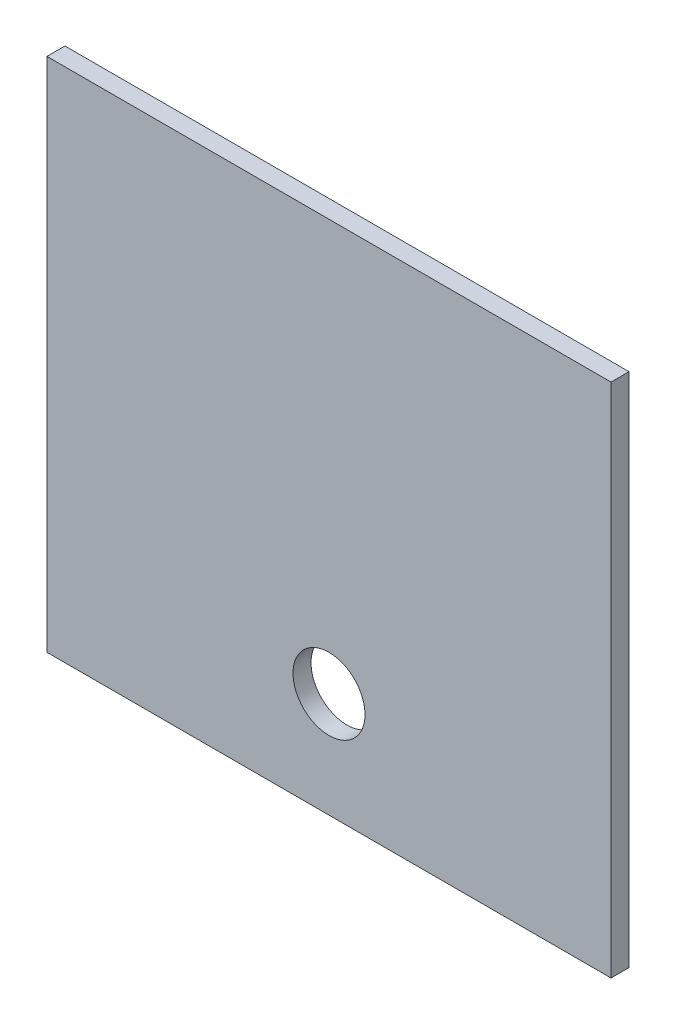
ISO-10303-21;
HEADER;
FILE_DESCRIPTION(('STEP AP214'),'2;1');
FILE_NAME('part.step','',(''),(''),'','','');
FILE_SCHEMA(('AUTOMOTIVE_DESIGN { 1 0 10303 214 1 1 1 1 }'));
ENDSEC;
DATA;
#1=APPLICATION_CONTEXT('core data for automotive mechanical design processes');
#2=APPLICATION_PROTOCOL_DEFINITION('international standard','automotive_design',2000,#1);
#3=PRODUCT_CONTEXT('',#1,'mechanical');
#4=PRODUCT('Part','Part','',(#3));
#5=PRODUCT_RELATED_PRODUCT_CATEGORY('part','',(#4));
#6=PRODUCT_DEFINITION_FORMATION('','',#4);
#7=PRODUCT_DEFINITION_CONTEXT('part definition',#1,'design');
#8=PRODUCT_DEFINITION('design','',#6,#7);
#9=PRODUCT_DEFINITION_SHAPE('','',#8);
#10=(LENGTH_UNIT() NAMED_UNIT(*) SI_UNIT(.MILLI.,.METRE.));
#11=(NAMED_UNIT(*) PLANE_ANGLE_UNIT() SI_UNIT($,.RADIAN.));
#12=(NAMED_UNIT(*) SI_UNIT($,.STERADIAN.) SOLID_ANGLE_UNIT());
#13=UNCERTAINTY_MEASURE_WITH_UNIT(LENGTH_MEASURE(1.E-05),#10,'distance_accuracy_value','');
#14=(GEOMETRIC_REPRESENTATION_CONTEXT(3) GLOBAL_UNCERTAINTY_ASSIGNED_CONTEXT((#13)) GLOBAL_UNIT_ASSIGNED_CONTEXT((#10,
#11,#12)) REPRESENTATION_CONTEXT('',''));
#15=CARTESIAN_POINT('',(0.,0.,0.));
#16=DIRECTION('',(0.,0.,1.));
#17=DIRECTION('',(1.,0.,0.));
#18=AXIS2_PLACEMENT_3D('',#15,#16,#17);
#19=CARTESIAN_POINT('',(-298.45,-152.4,19.05));
#20=DIRECTION('',(1.,0.,0.));
#21=DIRECTION('',(0.,0.,-1.));
#22=AXIS2_PLACEMENT_3D('',#19,#20,#21);
#23=PLANE('',#22);
#24=DIRECTION('',(0.,-1.,0.));
#25=VECTOR('',#24,1.);
#26=CARTESIAN_POINT('',(-298.45,-152.4,0.));
#27=LINE('',#26,#25);
#28=CARTESIAN_POINT('',(-298.45,177.8,0.));
#29=VERTEX_POINT('',#28);
#30=CARTESIAN_POINT('',(-298.45,-368.3,0.));
#31=VERTEX_POINT('',#30);
#32=EDGE_CURVE('E76',#29,#31,#27,.T.);
#33=ORIENTED_EDGE('',*,*,#32,.T.);
#34=DIRECTION('',(0.,0.,-1.));
#35=VECTOR('',#34,1.);
#36=CARTESIAN_POINT('',(-298.45,-368.3,19.05));
#37=LINE('',#36,#35);
#38=CARTESIAN_POINT('',(-298.45,-368.3,19.05));
#39=VERTEX_POINT('',#38);
#40=EDGE_CURVE('E79',#39,#31,#37,.T.);
#41=ORIENTED_EDGE('',*,*,#40,.F.);
#42=DIRECTION('',(0.,-1.,0.));
#43=VECTOR('',#42,1.);
#44=CARTESIAN_POINT('',(-298.45,-152.4,19.05));
#45=LINE('',#44,#43);
#46=CARTESIAN_POINT('',(-298.45,177.8,19.05));
#47=VERTEX_POINT('',#46);
#48=EDGE_CURVE('E46',#47,#39,#45,.T.);
#49=ORIENTED_EDGE('',*,*,#48,.F.);
#50=DIRECTION('',(0.,0.,1.));
#51=VECTOR('',#50,1.);
#52=CARTESIAN_POINT('',(-298.45,177.8,0.));
#53=LINE('',#52,#51);
#54=EDGE_CURVE('E80',#29,#47,#53,.T.);
#55=ORIENTED_EDGE('',*,*,#54,.F.);
#56=EDGE_LOOP('',(#33,#41,#49,#55));
#57=FACE_BOUND('',#56,.T.);
#58=ADVANCED_FACE('F38',(#57),#23,.F.);
#59=CARTESIAN_POINT('',(298.45,-152.4,19.05));
#60=DIRECTION('',(-1.,0.,0.));
#61=DIRECTION('',(0.,0.,1.));
#62=AXIS2_PLACEMENT_3D('',#59,#60,#61);
#63=PLANE('',#62);
#64=DIRECTION('',(0.,1.,0.));
#65=VECTOR('',#64,1.);
#66=CARTESIAN_POINT('',(298.45,-152.4,0.));
#67=LINE('',#66,#65);
#68=CARTESIAN_POINT('',(298.45,-368.3,0.));
#69=VERTEX_POINT('',#68);
#70=CARTESIAN_POINT('',(298.45,177.8,0.));
#71=VERTEX_POINT('',#70);
#72=EDGE_CURVE('E41',#69,#71,#67,.T.);
#73=ORIENTED_EDGE('',*,*,#72,.T.);
#74=DIRECTION('',(0.,0.,-1.));
#75=VECTOR('',#74,1.);
#76=CARTESIAN_POINT('',(298.45,177.8,19.05));
#77=LINE('',#76,#75);
#78=CARTESIAN_POINT('',(298.45,177.8,19.05));
#79=VERTEX_POINT('',#78);
#80=EDGE_CURVE('E105',#79,#71,#77,.T.);
#81=ORIENTED_EDGE('',*,*,#80,.F.);
#82=DIRECTION('',(0.,1.,0.));
#83=VECTOR('',#82,1.);
#84=CARTESIAN_POINT('',(298.45,-152.4,19.05));
#85=LINE('',#84,#83);
#86=CARTESIAN_POINT('',(298.45,-368.3,19.05));
#87=VERTEX_POINT('',#86);
#88=EDGE_CURVE('E11',#87,#79,#85,.T.);
#89=ORIENTED_EDGE('',*,*,#88,.F.);
#90=DIRECTION('',(0.,0.,1.));
#91=VECTOR('',#90,1.);
#92=CARTESIAN_POINT('',(298.45,-368.3,0.));
#93=LINE('',#92,#91);
#94=EDGE_CURVE('E91',#69,#87,#93,.T.);
#95=ORIENTED_EDGE('',*,*,#94,.F.);
#96=EDGE_LOOP('',(#73,#81,#89,#95));
#97=FACE_BOUND('',#96,.T.);
#98=ADVANCED_FACE('F114',(#97),#63,.F.);
#99=CARTESIAN_POINT('',(0.,0.,19.05));
#100=DIRECTION('',(0.,0.,-1.));
#101=DIRECTION('',(-1.,0.,0.));
#102=AXIS2_PLACEMENT_3D('',#99,#100,#101);
#103=PLANE('',#102);
#104=CARTESIAN_POINT('',(0.,-257.175,19.05));
#105=DIRECTION('',(0.,0.,1.));
#106=DIRECTION('',(1.,0.,0.));
#107=AXIS2_PLACEMENT_3D('',#104,#105,#106);
#108=CIRCLE('',#107,38.1);
#109=CARTESIAN_POINT('',(38.1000000000001,-257.175,19.05));
#110=VERTEX_POINT('',#109);
#111=EDGE_CURVE('E99',#110,#110,#108,.T.);
#112=ORIENTED_EDGE('',*,*,#111,.F.);
#113=EDGE_LOOP('',(#112));
#114=FACE_BOUND('',#113,.T.);
#115=ORIENTED_EDGE('',*,*,#48,.T.);
#116=DIRECTION('',(-1.,0.,0.));
#117=VECTOR('',#116,1.);
#118=CARTESIAN_POINT('',(298.45,-368.3,19.05));
#119=LINE('',#118,#117);
#120=EDGE_CURVE('E95',#87,#39,#119,.T.);
#121=ORIENTED_EDGE('',*,*,#120,.F.);
#122=ORIENTED_EDGE('',*,*,#88,.T.);
#123=DIRECTION('',(1.,0.,0.));
#124=VECTOR('',#123,1.);
#125=CARTESIAN_POINT('',(-298.45,177.8,19.05));
#126=LINE('',#125,#124);
#127=EDGE_CURVE('E84',#47,#79,#126,.T.);
#128=ORIENTED_EDGE('',*,*,#127,.F.);
#129=EDGE_LOOP('',(#115,#121,#122,#128));
#130=FACE_BOUND('',#129,.T.);
#131=ADVANCED_FACE('F117',(#114,#130),#103,.F.);
#132=CARTESIAN_POINT('',(0.,0.,0.));
#133=DIRECTION('',(0.,0.,-1.));
#134=DIRECTION('',(-1.,0.,0.));
#135=AXIS2_PLACEMENT_3D('',#132,#133,#134);
#136=PLANE('',#135);
#137=CARTESIAN_POINT('',(0.,-257.175,0.));
#138=DIRECTION('',(0.,0.,1.));
#139=DIRECTION('',(1.,0.,0.));
#140=AXIS2_PLACEMENT_3D('',#137,#138,#139);
#141=CIRCLE('',#140,38.1);
#142=CARTESIAN_POINT('',(38.1000000000001,-257.175,0.));
#143=VERTEX_POINT('',#142);
#144=EDGE_CURVE('E96',#143,#143,#141,.T.);
#145=ORIENTED_EDGE('',*,*,#144,.T.);
#146=EDGE_LOOP('',(#145));
#147=FACE_BOUND('',#146,.T.);
#148=ORIENTED_EDGE('',*,*,#32,.F.);
#149=DIRECTION('',(-1.,0.,0.));
#150=VECTOR('',#149,1.);
#151=CARTESIAN_POINT('',(298.45,177.8,0.));
#152=LINE('',#151,#150);
#153=EDGE_CURVE('E108',#71,#29,#152,.T.);
#154=ORIENTED_EDGE('',*,*,#153,.F.);
#155=ORIENTED_EDGE('',*,*,#72,.F.);
#156=DIRECTION('',(1.,0.,0.));
#157=VECTOR('',#156,1.);
#158=CARTESIAN_POINT('',(-298.45,-368.3,0.));
#159=LINE('',#158,#157);
#160=EDGE_CURVE('E86',#31,#69,#159,.T.);
#161=ORIENTED_EDGE('',*,*,#160,.F.);
#162=EDGE_LOOP('',(#148,#154,#155,#161));
#163=FACE_BOUND('',#162,.T.);
#164=ADVANCED_FACE('F87',(#147,#163),#136,.T.);
#165=CARTESIAN_POINT('',(0.,177.8,0.));
#166=DIRECTION('',(0.,1.,0.));
#167=DIRECTION('',(0.,0.,1.));
#168=AXIS2_PLACEMENT_3D('',#165,#166,#167);
#169=PLANE('',#168);
#170=ORIENTED_EDGE('',*,*,#80,.T.);
#171=ORIENTED_EDGE('',*,*,#153,.T.);
#172=ORIENTED_EDGE('',*,*,#54,.T.);
#173=ORIENTED_EDGE('',*,*,#127,.T.);
#174=EDGE_LOOP('',(#170,#171,#172,#173));
#175=FACE_BOUND('',#174,.T.);
#176=ADVANCED_FACE('F116',(#175),#169,.T.);
#177=CARTESIAN_POINT('',(0.,-368.3,0.));
#178=DIRECTION('',(0.,-1.,0.));
#179=DIRECTION('',(0.,0.,-1.));
#180=AXIS2_PLACEMENT_3D('',#177,#178,#179);
#181=PLANE('',#180);
#182=ORIENTED_EDGE('',*,*,#40,.T.);
#183=ORIENTED_EDGE('',*,*,#160,.T.);
#184=ORIENTED_EDGE('',*,*,#94,.T.);
#185=ORIENTED_EDGE('',*,*,#120,.T.);
#186=EDGE_LOOP('',(#182,#183,#184,#185));
#187=FACE_BOUND('',#186,.T.);
#188=ADVANCED_FACE('F94',(#187),#181,.T.);
#189=CARTESIAN_POINT('',(0.,-257.175,0.));
#190=DIRECTION('',(0.,0.,1.));
#191=DIRECTION('',(1.,0.,0.));
#192=AXIS2_PLACEMENT_3D('',#189,#190,#191);
#193=CYLINDRICAL_SURFACE('',#192,38.1);
#194=ORIENTED_EDGE('',*,*,#144,.F.);
#195=EDGE_LOOP('',(#194));
#196=FACE_BOUND('',#195,.T.);
#197=ORIENTED_EDGE('',*,*,#111,.T.);
#198=EDGE_LOOP('',(#197));
#199=FACE_BOUND('',#198,.T.);
#200=ADVANCED_FACE('F146',(#196,#199),#193,.F.);
#201=CLOSED_SHELL('',(#58,#98,#131,#164,#176,#188,#200));
#202=MANIFOLD_SOLID_BREP('B2',#201);
#203=ADVANCED_BREP_SHAPE_REPRESENTATION('',(#18,#202),#14);
#204=SHAPE_DEFINITION_REPRESENTATION(#9,#203);
ENDSEC;
END-ISO-10303-21;
